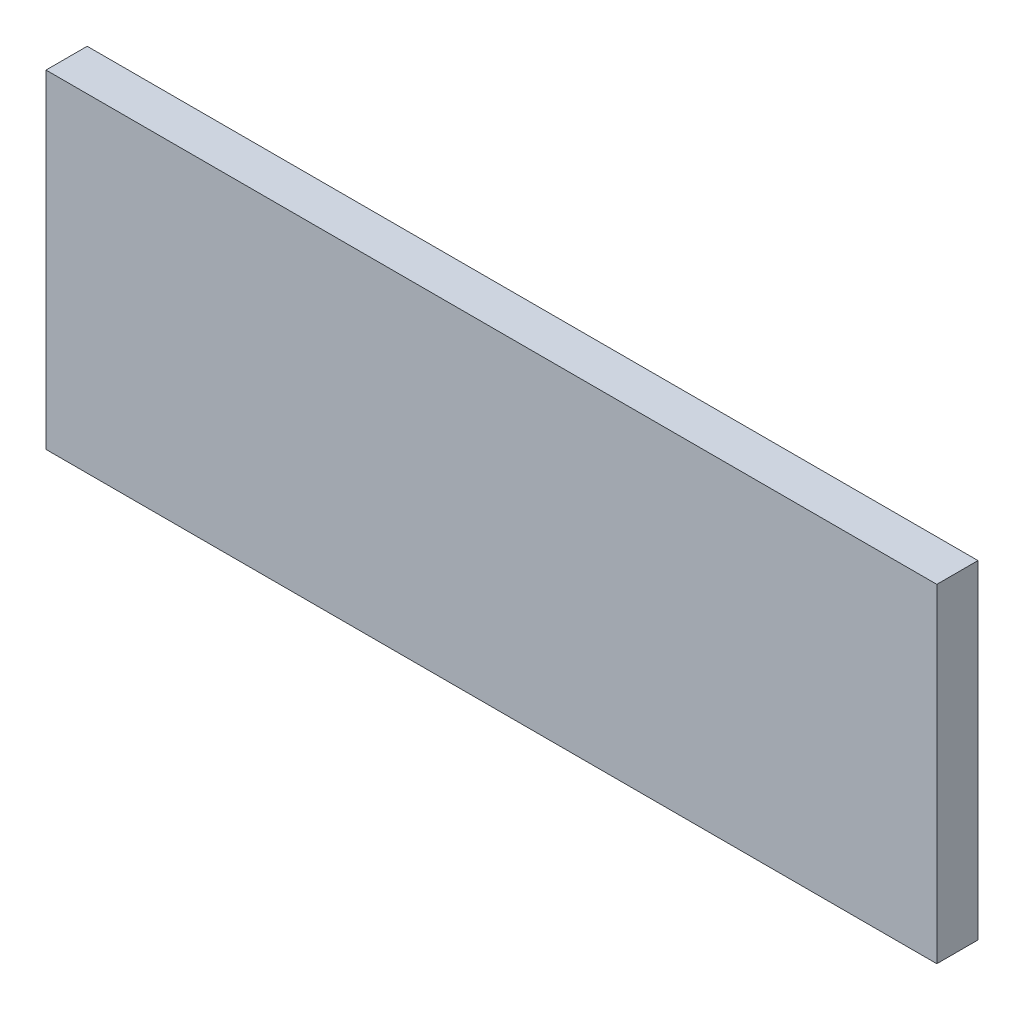
ISO-10303-21;
HEADER;
FILE_DESCRIPTION(('STEP AP214'),'2;1');
FILE_NAME('part.step','',(''),(''),'','','');
FILE_SCHEMA(('AUTOMOTIVE_DESIGN { 1 0 10303 214 1 1 1 1 }'));
ENDSEC;
DATA;
#1=APPLICATION_CONTEXT('core data for automotive mechanical design processes');
#2=APPLICATION_PROTOCOL_DEFINITION('international standard','automotive_design',2000,#1);
#3=PRODUCT_CONTEXT('',#1,'mechanical');
#4=PRODUCT('Part','Part','',(#3));
#5=PRODUCT_RELATED_PRODUCT_CATEGORY('part','',(#4));
#6=PRODUCT_DEFINITION_FORMATION('','',#4);
#7=PRODUCT_DEFINITION_CONTEXT('part definition',#1,'design');
#8=PRODUCT_DEFINITION('design','',#6,#7);
#9=PRODUCT_DEFINITION_SHAPE('','',#8);
#10=(LENGTH_UNIT() NAMED_UNIT(*) SI_UNIT(.MILLI.,.METRE.));
#11=(NAMED_UNIT(*) PLANE_ANGLE_UNIT() SI_UNIT($,.RADIAN.));
#12=(NAMED_UNIT(*) SI_UNIT($,.STERADIAN.) SOLID_ANGLE_UNIT());
#13=UNCERTAINTY_MEASURE_WITH_UNIT(LENGTH_MEASURE(1.E-05),#10,'distance_accuracy_value','');
#14=(GEOMETRIC_REPRESENTATION_CONTEXT(3) GLOBAL_UNCERTAINTY_ASSIGNED_CONTEXT((#13)) GLOBAL_UNIT_ASSIGNED_CONTEXT((#10,
#11,#12)) REPRESENTATION_CONTEXT('',''));
#15=CARTESIAN_POINT('',(0.,0.,0.));
#16=DIRECTION('',(0.,0.,1.));
#17=DIRECTION('',(1.,0.,0.));
#18=AXIS2_PLACEMENT_3D('',#15,#16,#17);
#19=CARTESIAN_POINT('',(21.62700272,7.97699954,0.));
#20=DIRECTION('',(-5.87228890024599E-08,-0.999999999999998,0.));
#21=DIRECTION('',(-0.999999999999998,5.87228890024599E-08,0.));
#22=AXIS2_PLACEMENT_3D('',#19,#20,#21);
#23=PLANE('',#22);
#24=DIRECTION('',(-0.999999999999998,5.87228890024599E-08,0.));
#25=VECTOR('',#24,1.);
#26=CARTESIAN_POINT('',(21.62700272,7.97699954,0.));
#27=LINE('',#26,#25);
#28=CARTESIAN_POINT('',(21.62700272,7.97699954,0.));
#29=VERTEX_POINT('',#28);
#30=CARTESIAN_POINT('',(-21.62700018,7.97700208,0.));
#31=VERTEX_POINT('',#30);
#32=EDGE_CURVE('E11',#29,#31,#27,.T.);
#33=ORIENTED_EDGE('',*,*,#32,.T.);
#34=DIRECTION('',(0.,0.,1.));
#35=VECTOR('',#34,1.);
#36=CARTESIAN_POINT('',(-21.62700018,7.97700208,0.));
#37=LINE('',#36,#35);
#38=CARTESIAN_POINT('',(-21.62700018,7.97700208,2.00000108));
#39=VERTEX_POINT('',#38);
#40=EDGE_CURVE('E24',#31,#39,#37,.T.);
#41=ORIENTED_EDGE('',*,*,#40,.T.);
#42=DIRECTION('',(-0.999999999999998,5.87228890024599E-08,0.));
#43=VECTOR('',#42,1.);
#44=CARTESIAN_POINT('',(21.62700272,7.97699954,2.00000108));
#45=LINE('',#44,#43);
#46=CARTESIAN_POINT('',(21.62700272,7.97699954,2.00000108));
#47=VERTEX_POINT('',#46);
#48=EDGE_CURVE('E87',#47,#39,#45,.T.);
#49=ORIENTED_EDGE('',*,*,#48,.F.);
#50=DIRECTION('',(0.,0.,1.));
#51=VECTOR('',#50,1.);
#52=CARTESIAN_POINT('',(21.62700272,7.97699954,0.));
#53=LINE('',#52,#51);
#54=EDGE_CURVE('E36',#29,#47,#53,.T.);
#55=ORIENTED_EDGE('',*,*,#54,.F.);
#56=EDGE_LOOP('',(#33,#41,#49,#55));
#57=FACE_BOUND('',#56,.T.);
#58=ADVANCED_FACE('F17',(#57),#23,.F.);
#59=CARTESIAN_POINT('',(-21.62700018,7.97700208,0.));
#60=DIRECTION('',(1.,0.,0.));
#61=DIRECTION('',(0.,-1.,0.));
#62=AXIS2_PLACEMENT_3D('',#59,#60,#61);
#63=PLANE('',#62);
#64=DIRECTION('',(0.,-1.,0.));
#65=VECTOR('',#64,1.);
#66=CARTESIAN_POINT('',(-21.62700018,7.97700208,0.));
#67=LINE('',#66,#65);
#68=CARTESIAN_POINT('',(-21.62700018,-7.97700208,0.));
#69=VERTEX_POINT('',#68);
#70=EDGE_CURVE('E84',#31,#69,#67,.T.);
#71=ORIENTED_EDGE('',*,*,#70,.T.);
#72=DIRECTION('',(0.,0.,1.));
#73=VECTOR('',#72,1.);
#74=CARTESIAN_POINT('',(-21.62700018,-7.97700208,0.));
#75=LINE('',#74,#73);
#76=CARTESIAN_POINT('',(-21.62700018,-7.97700208,2.00000108));
#77=VERTEX_POINT('',#76);
#78=EDGE_CURVE('E82',#69,#77,#75,.T.);
#79=ORIENTED_EDGE('',*,*,#78,.T.);
#80=DIRECTION('',(0.,-1.,0.));
#81=VECTOR('',#80,1.);
#82=CARTESIAN_POINT('',(-21.62700018,7.97700208,2.00000108));
#83=LINE('',#82,#81);
#84=EDGE_CURVE('E62',#39,#77,#83,.T.);
#85=ORIENTED_EDGE('',*,*,#84,.F.);
#86=ORIENTED_EDGE('',*,*,#40,.F.);
#87=EDGE_LOOP('',(#71,#79,#85,#86));
#88=FACE_BOUND('',#87,.T.);
#89=ADVANCED_FACE('F89',(#88),#63,.F.);
#90=CARTESIAN_POINT('',(-21.62700018,-7.97700208,0.));
#91=DIRECTION('',(0.,1.,0.));
#92=DIRECTION('',(1.,0.,0.));
#93=AXIS2_PLACEMENT_3D('',#90,#91,#92);
#94=PLANE('',#93);
#95=DIRECTION('',(1.,0.,0.));
#96=VECTOR('',#95,1.);
#97=CARTESIAN_POINT('',(-21.62700018,-7.97700208,0.));
#98=LINE('',#97,#96);
#99=CARTESIAN_POINT('',(21.62700018,-7.97700208,0.));
#100=VERTEX_POINT('',#99);
#101=EDGE_CURVE('E71',#69,#100,#98,.T.);
#102=ORIENTED_EDGE('',*,*,#101,.T.);
#103=DIRECTION('',(0.,0.,1.));
#104=VECTOR('',#103,1.);
#105=CARTESIAN_POINT('',(21.62700018,-7.97700208,0.));
#106=LINE('',#105,#104);
#107=CARTESIAN_POINT('',(21.62700018,-7.97700208,2.00000108));
#108=VERTEX_POINT('',#107);
#109=EDGE_CURVE('E65',#100,#108,#106,.T.);
#110=ORIENTED_EDGE('',*,*,#109,.T.);
#111=DIRECTION('',(1.,0.,0.));
#112=VECTOR('',#111,1.);
#113=CARTESIAN_POINT('',(-21.62700018,-7.97700208,2.00000108));
#114=LINE('',#113,#112);
#115=EDGE_CURVE('E57',#77,#108,#114,.T.);
#116=ORIENTED_EDGE('',*,*,#115,.F.);
#117=ORIENTED_EDGE('',*,*,#78,.F.);
#118=EDGE_LOOP('',(#102,#110,#116,#117));
#119=FACE_BOUND('',#118,.T.);
#120=ADVANCED_FACE('F69',(#119),#94,.F.);
#121=CARTESIAN_POINT('',(21.62700018,-7.97700208,0.));
#122=DIRECTION('',(-0.999999999999987,1.59207705846898E-07,0.));
#123=DIRECTION('',(1.59207705846898E-07,0.999999999999987,0.));
#124=AXIS2_PLACEMENT_3D('',#121,#122,#123);
#125=PLANE('',#124);
#126=DIRECTION('',(1.59207705846898E-07,0.999999999999987,0.));
#127=VECTOR('',#126,1.);
#128=CARTESIAN_POINT('',(21.62700018,-7.97700208,0.));
#129=LINE('',#128,#127);
#130=EDGE_CURVE('E66',#100,#29,#129,.T.);
#131=ORIENTED_EDGE('',*,*,#130,.T.);
#132=ORIENTED_EDGE('',*,*,#54,.T.);
#133=DIRECTION('',(1.59207705846898E-07,0.999999999999987,0.));
#134=VECTOR('',#133,1.);
#135=CARTESIAN_POINT('',(21.62700018,-7.97700208,2.00000108));
#136=LINE('',#135,#134);
#137=EDGE_CURVE('E61',#108,#47,#136,.T.);
#138=ORIENTED_EDGE('',*,*,#137,.F.);
#139=ORIENTED_EDGE('',*,*,#109,.F.);
#140=EDGE_LOOP('',(#131,#132,#138,#139));
#141=FACE_BOUND('',#140,.T.);
#142=ADVANCED_FACE('F76',(#141),#125,.F.);
#143=CARTESIAN_POINT('',(21.62700272,7.97699954,0.));
#144=DIRECTION('',(0.,0.,-1.));
#145=DIRECTION('',(-1.,0.,0.));
#146=AXIS2_PLACEMENT_3D('',#143,#144,#145);
#147=PLANE('',#146);
#148=ORIENTED_EDGE('',*,*,#130,.F.);
#149=ORIENTED_EDGE('',*,*,#101,.F.);
#150=ORIENTED_EDGE('',*,*,#70,.F.);
#151=ORIENTED_EDGE('',*,*,#32,.F.);
#152=EDGE_LOOP('',(#148,#149,#150,#151));
#153=FACE_BOUND('',#152,.T.);
#154=ADVANCED_FACE('F91',(#153),#147,.T.);
#155=CARTESIAN_POINT('',(21.62700272,7.97699954,2.00000108));
#156=DIRECTION('',(0.,0.,-1.));
#157=DIRECTION('',(-1.,0.,0.));
#158=AXIS2_PLACEMENT_3D('',#155,#156,#157);
#159=PLANE('',#158);
#160=ORIENTED_EDGE('',*,*,#48,.T.);
#161=ORIENTED_EDGE('',*,*,#84,.T.);
#162=ORIENTED_EDGE('',*,*,#115,.T.);
#163=ORIENTED_EDGE('',*,*,#137,.T.);
#164=EDGE_LOOP('',(#160,#161,#162,#163));
#165=FACE_BOUND('',#164,.T.);
#166=ADVANCED_FACE('F59',(#165),#159,.F.);
#167=CLOSED_SHELL('',(#58,#89,#120,#142,#154,#166));
#168=MANIFOLD_SOLID_BREP('B1',#167);
#169=ADVANCED_BREP_SHAPE_REPRESENTATION('',(#18,#168),#14);
#170=SHAPE_DEFINITION_REPRESENTATION(#9,#169);
ENDSEC;
END-ISO-10303-21;
